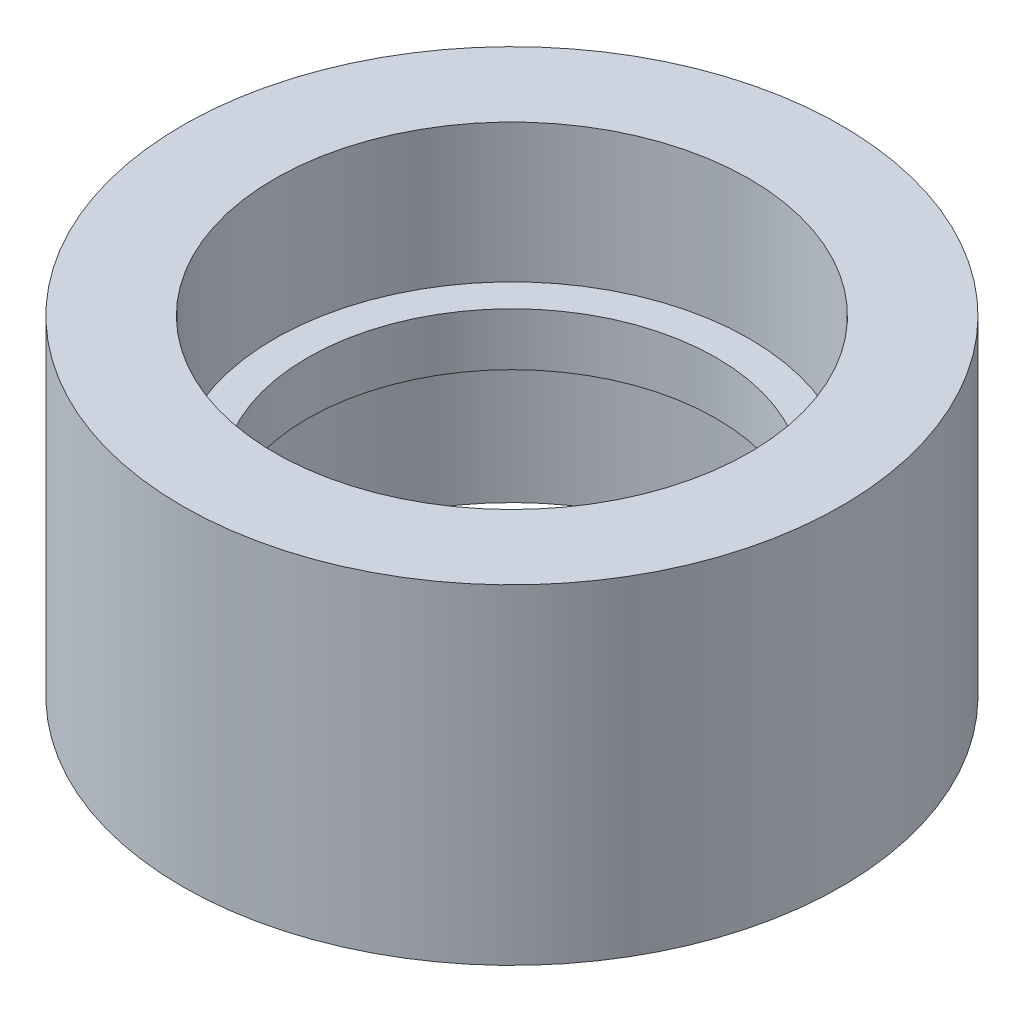
ISO-10303-21;
HEADER;
FILE_DESCRIPTION(('STEP AP214'),'2;1');
FILE_NAME('part.step','',(''),(''),'','','');
FILE_SCHEMA(('AUTOMOTIVE_DESIGN { 1 0 10303 214 1 1 1 1 }'));
ENDSEC;
DATA;
#1=APPLICATION_CONTEXT('core data for automotive mechanical design processes');
#2=APPLICATION_PROTOCOL_DEFINITION('international standard','automotive_design',2000,#1);
#3=PRODUCT_CONTEXT('',#1,'mechanical');
#4=PRODUCT('Part','Part','',(#3));
#5=PRODUCT_RELATED_PRODUCT_CATEGORY('part','',(#4));
#6=PRODUCT_DEFINITION_FORMATION('','',#4);
#7=PRODUCT_DEFINITION_CONTEXT('part definition',#1,'design');
#8=PRODUCT_DEFINITION('design','',#6,#7);
#9=PRODUCT_DEFINITION_SHAPE('','',#8);
#10=(LENGTH_UNIT() NAMED_UNIT(*) SI_UNIT(.MILLI.,.METRE.));
#11=(NAMED_UNIT(*) PLANE_ANGLE_UNIT() SI_UNIT($,.RADIAN.));
#12=(NAMED_UNIT(*) SI_UNIT($,.STERADIAN.) SOLID_ANGLE_UNIT());
#13=UNCERTAINTY_MEASURE_WITH_UNIT(LENGTH_MEASURE(1.E-05),#10,'distance_accuracy_value','');
#14=(GEOMETRIC_REPRESENTATION_CONTEXT(3) GLOBAL_UNCERTAINTY_ASSIGNED_CONTEXT((#13)) GLOBAL_UNIT_ASSIGNED_CONTEXT((#10,
#11,#12)) REPRESENTATION_CONTEXT('',''));
#15=CARTESIAN_POINT('',(0.,0.,0.));
#16=DIRECTION('',(0.,0.,1.));
#17=DIRECTION('',(1.,0.,0.));
#18=AXIS2_PLACEMENT_3D('',#15,#16,#17);
#19=CARTESIAN_POINT('',(0.,0.,0.));
#20=DIRECTION('',(0.,1.,0.));
#21=DIRECTION('',(0.,0.,1.));
#22=AXIS2_PLACEMENT_3D('',#19,#20,#21);
#23=CYLINDRICAL_SURFACE('',#22,31.);
#24=CARTESIAN_POINT('',(0.,29.,0.));
#25=DIRECTION('',(0.,1.,0.));
#26=DIRECTION('',(0.,0.,1.));
#27=AXIS2_PLACEMENT_3D('',#24,#25,#26);
#28=CIRCLE('',#27,31.);
#29=CARTESIAN_POINT('',(0.,29.,31.));
#30=VERTEX_POINT('',#29);
#31=EDGE_CURVE('E18',#30,#30,#28,.T.);
#32=ORIENTED_EDGE('',*,*,#31,.T.);
#33=EDGE_LOOP('',(#32));
#34=FACE_BOUND('',#33,.T.);
#35=CARTESIAN_POINT('',(0.,21.,0.));
#36=DIRECTION('',(0.,1.,0.));
#37=DIRECTION('',(0.,0.,1.));
#38=AXIS2_PLACEMENT_3D('',#35,#36,#37);
#39=CIRCLE('',#38,31.);
#40=CARTESIAN_POINT('',(0.,21.,31.));
#41=VERTEX_POINT('',#40);
#42=EDGE_CURVE('E40',#41,#41,#39,.F.);
#43=ORIENTED_EDGE('',*,*,#42,.T.);
#44=EDGE_LOOP('',(#43));
#45=FACE_BOUND('',#44,.T.);
#46=ADVANCED_FACE('F15',(#34,#45),#23,.F.);
#47=CARTESIAN_POINT('',(0.,29.,0.));
#48=DIRECTION('',(0.,-1.,0.));
#49=DIRECTION('',(0.,0.,-1.));
#50=AXIS2_PLACEMENT_3D('',#47,#48,#49);
#51=PLANE('',#50);
#52=ORIENTED_EDGE('',*,*,#31,.F.);
#53=EDGE_LOOP('',(#52));
#54=FACE_BOUND('',#53,.T.);
#55=CARTESIAN_POINT('',(0.,29.,0.));
#56=DIRECTION('',(0.,-1.,0.));
#57=DIRECTION('',(0.,0.,-1.));
#58=AXIS2_PLACEMENT_3D('',#55,#56,#57);
#59=CIRCLE('',#58,36.);
#60=CARTESIAN_POINT('',(0.,29.,-36.));
#61=VERTEX_POINT('',#60);
#62=EDGE_CURVE('E38',#61,#61,#59,.F.);
#63=ORIENTED_EDGE('',*,*,#62,.T.);
#64=EDGE_LOOP('',(#63));
#65=FACE_BOUND('',#64,.T.);
#66=ADVANCED_FACE('F48',(#54,#65),#51,.F.);
#67=CARTESIAN_POINT('',(0.,21.,0.));
#68=DIRECTION('',(0.,1.,0.));
#69=DIRECTION('',(0.,0.,1.));
#70=AXIS2_PLACEMENT_3D('',#67,#68,#69);
#71=PLANE('',#70);
#72=ORIENTED_EDGE('',*,*,#42,.F.);
#73=EDGE_LOOP('',(#72));
#74=FACE_BOUND('',#73,.T.);
#75=CARTESIAN_POINT('',(0.,21.,0.));
#76=DIRECTION('',(0.,1.,0.));
#77=DIRECTION('',(0.,0.,1.));
#78=AXIS2_PLACEMENT_3D('',#75,#76,#77);
#79=CIRCLE('',#78,36.);
#80=CARTESIAN_POINT('',(0.,21.,36.));
#81=VERTEX_POINT('',#80);
#82=EDGE_CURVE('E35',#81,#81,#79,.F.);
#83=ORIENTED_EDGE('',*,*,#82,.T.);
#84=EDGE_LOOP('',(#83));
#85=FACE_BOUND('',#84,.T.);
#86=ADVANCED_FACE('F51',(#74,#85),#71,.F.);
#87=CARTESIAN_POINT('',(0.,79.,0.));
#88=DIRECTION('',(0.,-1.,0.));
#89=DIRECTION('',(0.,0.,-1.));
#90=AXIS2_PLACEMENT_3D('',#87,#88,#89);
#91=CYLINDRICAL_SURFACE('',#90,36.);
#92=ORIENTED_EDGE('',*,*,#62,.F.);
#93=EDGE_LOOP('',(#92));
#94=FACE_BOUND('',#93,.T.);
#95=CARTESIAN_POINT('',(0.,50.,0.));
#96=DIRECTION('',(0.,-1.,0.));
#97=DIRECTION('',(0.,0.,-1.));
#98=AXIS2_PLACEMENT_3D('',#95,#96,#97);
#99=CIRCLE('',#98,36.);
#100=CARTESIAN_POINT('',(0.,50.,-36.));
#101=VERTEX_POINT('',#100);
#102=EDGE_CURVE('E32',#101,#101,#99,.T.);
#103=ORIENTED_EDGE('',*,*,#102,.F.);
#104=EDGE_LOOP('',(#103));
#105=FACE_BOUND('',#104,.T.);
#106=ADVANCED_FACE('F54',(#94,#105),#91,.F.);
#107=CARTESIAN_POINT('',(0.,-29.,0.));
#108=DIRECTION('',(0.,1.,0.));
#109=DIRECTION('',(0.,0.,1.));
#110=AXIS2_PLACEMENT_3D('',#107,#108,#109);
#111=CYLINDRICAL_SURFACE('',#110,36.);
#112=ORIENTED_EDGE('',*,*,#82,.F.);
#113=EDGE_LOOP('',(#112));
#114=FACE_BOUND('',#113,.T.);
#115=CARTESIAN_POINT('',(0.,0.,0.));
#116=DIRECTION('',(0.,1.,0.));
#117=DIRECTION('',(0.,0.,1.));
#118=AXIS2_PLACEMENT_3D('',#115,#116,#117);
#119=CIRCLE('',#118,36.);
#120=CARTESIAN_POINT('',(0.,0.,36.));
#121=VERTEX_POINT('',#120);
#122=EDGE_CURVE('E27',#121,#121,#119,.F.);
#123=ORIENTED_EDGE('',*,*,#122,.T.);
#124=EDGE_LOOP('',(#123));
#125=FACE_BOUND('',#124,.T.);
#126=ADVANCED_FACE('F57',(#114,#125),#111,.F.);
#127=CARTESIAN_POINT('',(0.,50.,0.));
#128=DIRECTION('',(0.,1.,0.));
#129=DIRECTION('',(0.,0.,1.));
#130=AXIS2_PLACEMENT_3D('',#127,#128,#129);
#131=PLANE('',#130);
#132=ORIENTED_EDGE('',*,*,#102,.T.);
#133=EDGE_LOOP('',(#132));
#134=FACE_BOUND('',#133,.T.);
#135=CARTESIAN_POINT('',(0.,50.,0.));
#136=DIRECTION('',(0.,1.,0.));
#137=DIRECTION('',(0.,0.,1.));
#138=AXIS2_PLACEMENT_3D('',#135,#136,#137);
#139=CIRCLE('',#138,50.);
#140=CARTESIAN_POINT('',(0.,50.,50.));
#141=VERTEX_POINT('',#140);
#142=EDGE_CURVE('E22',#141,#141,#139,.F.);
#143=ORIENTED_EDGE('',*,*,#142,.F.);
#144=EDGE_LOOP('',(#143));
#145=FACE_BOUND('',#144,.T.);
#146=ADVANCED_FACE('F61',(#134,#145),#131,.T.);
#147=CARTESIAN_POINT('',(0.,0.,0.));
#148=DIRECTION('',(0.,1.,0.));
#149=DIRECTION('',(0.,0.,1.));
#150=AXIS2_PLACEMENT_3D('',#147,#148,#149);
#151=PLANE('',#150);
#152=ORIENTED_EDGE('',*,*,#122,.F.);
#153=EDGE_LOOP('',(#152));
#154=FACE_BOUND('',#153,.T.);
#155=CARTESIAN_POINT('',(0.,0.,0.));
#156=DIRECTION('',(0.,1.,0.));
#157=DIRECTION('',(0.,0.,1.));
#158=AXIS2_PLACEMENT_3D('',#155,#156,#157);
#159=CIRCLE('',#158,50.);
#160=CARTESIAN_POINT('',(0.,0.,50.));
#161=VERTEX_POINT('',#160);
#162=EDGE_CURVE('E10',#161,#161,#159,.T.);
#163=ORIENTED_EDGE('',*,*,#162,.F.);
#164=EDGE_LOOP('',(#163));
#165=FACE_BOUND('',#164,.T.);
#166=ADVANCED_FACE('F64',(#154,#165),#151,.F.);
#167=CARTESIAN_POINT('',(0.,0.,0.));
#168=DIRECTION('',(0.,1.,0.));
#169=DIRECTION('',(0.,0.,1.));
#170=AXIS2_PLACEMENT_3D('',#167,#168,#169);
#171=CYLINDRICAL_SURFACE('',#170,50.);
#172=ORIENTED_EDGE('',*,*,#142,.T.);
#173=EDGE_LOOP('',(#172));
#174=FACE_BOUND('',#173,.T.);
#175=ORIENTED_EDGE('',*,*,#162,.T.);
#176=EDGE_LOOP('',(#175));
#177=FACE_BOUND('',#176,.T.);
#178=ADVANCED_FACE('F68',(#174,#177),#171,.T.);
#179=CLOSED_SHELL('',(#46,#66,#86,#106,#126,#146,#166,#178));
#180=MANIFOLD_SOLID_BREP('B1',#179);
#181=ADVANCED_BREP_SHAPE_REPRESENTATION('',(#18,#180),#14);
#182=SHAPE_DEFINITION_REPRESENTATION(#9,#181);
ENDSEC;
END-ISO-10303-21;
